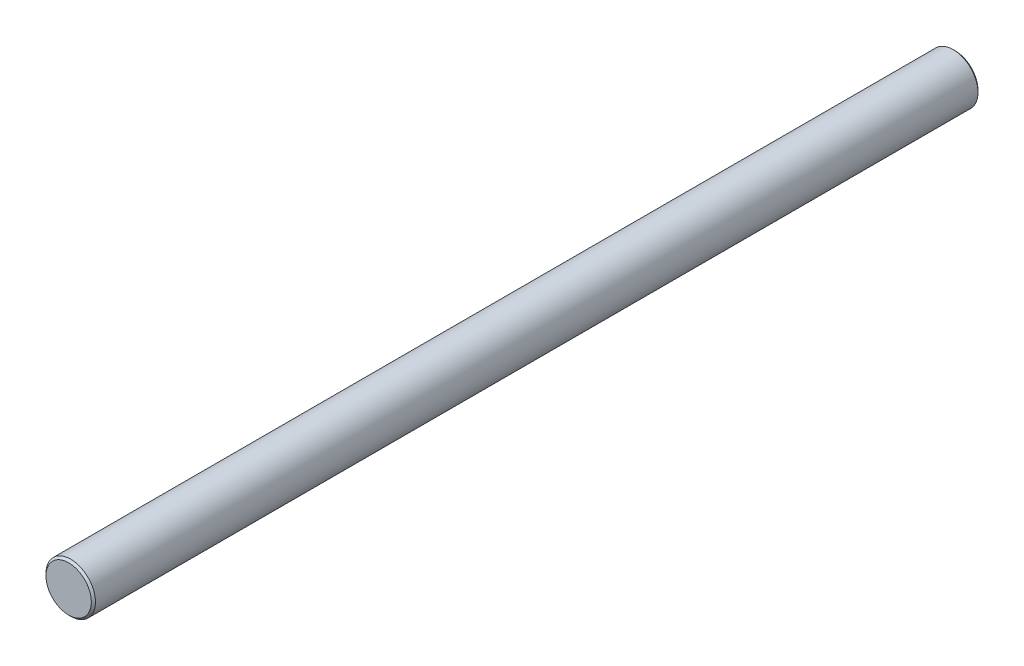
ISO-10303-21;
HEADER;
FILE_DESCRIPTION(('STEP AP214'),'2;1');
FILE_NAME('part.step','',(''),(''),'','','');
FILE_SCHEMA(('AUTOMOTIVE_DESIGN { 1 0 10303 214 1 1 1 1 }'));
ENDSEC;
DATA;
#1=APPLICATION_CONTEXT('core data for automotive mechanical design processes');
#2=APPLICATION_PROTOCOL_DEFINITION('international standard','automotive_design',2000,#1);
#3=PRODUCT_CONTEXT('',#1,'mechanical');
#4=PRODUCT('Part','Part','',(#3));
#5=PRODUCT_RELATED_PRODUCT_CATEGORY('part','',(#4));
#6=PRODUCT_DEFINITION_FORMATION('','',#4);
#7=PRODUCT_DEFINITION_CONTEXT('part definition',#1,'design');
#8=PRODUCT_DEFINITION('design','',#6,#7);
#9=PRODUCT_DEFINITION_SHAPE('','',#8);
#10=(LENGTH_UNIT() NAMED_UNIT(*) SI_UNIT(.MILLI.,.METRE.));
#11=(NAMED_UNIT(*) PLANE_ANGLE_UNIT() SI_UNIT($,.RADIAN.));
#12=(NAMED_UNIT(*) SI_UNIT($,.STERADIAN.) SOLID_ANGLE_UNIT());
#13=UNCERTAINTY_MEASURE_WITH_UNIT(LENGTH_MEASURE(1.E-05),#10,'distance_accuracy_value','');
#14=(GEOMETRIC_REPRESENTATION_CONTEXT(3) GLOBAL_UNCERTAINTY_ASSIGNED_CONTEXT((#13)) GLOBAL_UNIT_ASSIGNED_CONTEXT((#10,
#11,#12)) REPRESENTATION_CONTEXT('',''));
#15=CARTESIAN_POINT('',(0.,0.,0.));
#16=DIRECTION('',(0.,0.,1.));
#17=DIRECTION('',(1.,0.,0.));
#18=AXIS2_PLACEMENT_3D('',#15,#16,#17);
#19=CARTESIAN_POINT('',(0.,0.,107.5));
#20=DIRECTION('',(0.,0.,-1.));
#21=DIRECTION('',(-1.,0.,0.));
#22=AXIS2_PLACEMENT_3D('',#19,#20,#21);
#23=CYLINDRICAL_SURFACE('',#22,6.);
#24=CARTESIAN_POINT('',(0.,0.,-107.));
#25=DIRECTION('',(0.,0.,1.));
#26=DIRECTION('',(1.,0.,0.));
#27=AXIS2_PLACEMENT_3D('',#24,#25,#26);
#28=CIRCLE('',#27,6.);
#29=CARTESIAN_POINT('',(6.,0.,-107.));
#30=VERTEX_POINT('',#29);
#31=EDGE_CURVE('E50',#30,#30,#28,.T.);
#32=ORIENTED_EDGE('',*,*,#31,.T.);
#33=EDGE_LOOP('',(#32));
#34=FACE_BOUND('',#33,.T.);
#35=CARTESIAN_POINT('',(0.,0.,107.));
#36=DIRECTION('',(0.,0.,1.));
#37=DIRECTION('',(1.,0.,0.));
#38=AXIS2_PLACEMENT_3D('',#35,#36,#37);
#39=CIRCLE('',#38,6.);
#40=CARTESIAN_POINT('',(6.,0.,107.));
#41=VERTEX_POINT('',#40);
#42=EDGE_CURVE('E55',#41,#41,#39,.F.);
#43=ORIENTED_EDGE('',*,*,#42,.T.);
#44=EDGE_LOOP('',(#43));
#45=FACE_BOUND('',#44,.T.);
#46=ADVANCED_FACE('F37',(#34,#45),#23,.T.);
#47=CARTESIAN_POINT('',(0.,0.,107.5));
#48=DIRECTION('',(0.,0.,1.));
#49=DIRECTION('',(1.,0.,0.));
#50=AXIS2_PLACEMENT_3D('',#47,#48,#49);
#51=PLANE('',#50);
#52=CARTESIAN_POINT('',(0.,0.,107.5));
#53=DIRECTION('',(0.,0.,1.));
#54=DIRECTION('',(1.,0.,0.));
#55=AXIS2_PLACEMENT_3D('',#52,#53,#54);
#56=CIRCLE('',#55,5.50000000000003);
#57=CARTESIAN_POINT('',(5.50000000000003,0.,107.5));
#58=VERTEX_POINT('',#57);
#59=EDGE_CURVE('E10',#58,#58,#56,.T.);
#60=ORIENTED_EDGE('',*,*,#59,.T.);
#61=EDGE_LOOP('',(#60));
#62=FACE_BOUND('',#61,.T.);
#63=ADVANCED_FACE('F72',(#62),#51,.T.);
#64=CARTESIAN_POINT('',(0.,0.,-107.5));
#65=DIRECTION('',(0.,0.,1.));
#66=DIRECTION('',(1.,0.,0.));
#67=AXIS2_PLACEMENT_3D('',#64,#65,#66);
#68=PLANE('',#67);
#69=CARTESIAN_POINT('',(0.,0.,-107.5));
#70=DIRECTION('',(0.,0.,1.));
#71=DIRECTION('',(1.,0.,0.));
#72=AXIS2_PLACEMENT_3D('',#69,#70,#71);
#73=CIRCLE('',#72,5.49999999999998);
#74=CARTESIAN_POINT('',(5.49999999999998,0.,-107.5));
#75=VERTEX_POINT('',#74);
#76=EDGE_CURVE('E45',#75,#75,#73,.F.);
#77=ORIENTED_EDGE('',*,*,#76,.T.);
#78=EDGE_LOOP('',(#77));
#79=FACE_BOUND('',#78,.T.);
#80=ADVANCED_FACE('F69',(#79),#68,.F.);
#81=CARTESIAN_POINT('',(0.,0.,-107.));
#82=DIRECTION('',(0.,0.,1.));
#83=DIRECTION('',(1.,0.,0.));
#84=AXIS2_PLACEMENT_3D('',#81,#82,#83);
#85=CONICAL_SURFACE('',#84,6.,0.785398163397444);
#86=ORIENTED_EDGE('',*,*,#76,.F.);
#87=EDGE_LOOP('',(#86));
#88=FACE_BOUND('',#87,.T.);
#89=ORIENTED_EDGE('',*,*,#31,.F.);
#90=EDGE_LOOP('',(#89));
#91=FACE_BOUND('',#90,.T.);
#92=ADVANCED_FACE('F65',(#88,#91),#85,.T.);
#93=CARTESIAN_POINT('',(0.,0.,107.5));
#94=DIRECTION('',(0.,0.,-1.));
#95=DIRECTION('',(-1.,0.,0.));
#96=AXIS2_PLACEMENT_3D('',#93,#94,#95);
#97=CONICAL_SURFACE('',#96,5.50000000000003,0.785398163397458);
#98=ORIENTED_EDGE('',*,*,#42,.F.);
#99=EDGE_LOOP('',(#98));
#100=FACE_BOUND('',#99,.T.);
#101=ORIENTED_EDGE('',*,*,#59,.F.);
#102=EDGE_LOOP('',(#101));
#103=FACE_BOUND('',#102,.T.);
#104=ADVANCED_FACE('F39',(#100,#103),#97,.T.);
#105=CLOSED_SHELL('',(#46,#63,#80,#92,#104));
#106=MANIFOLD_SOLID_BREP('B2',#105);
#107=ADVANCED_BREP_SHAPE_REPRESENTATION('',(#18,#106),#14);
#108=SHAPE_DEFINITION_REPRESENTATION(#9,#107);
ENDSEC;
END-ISO-10303-21;
